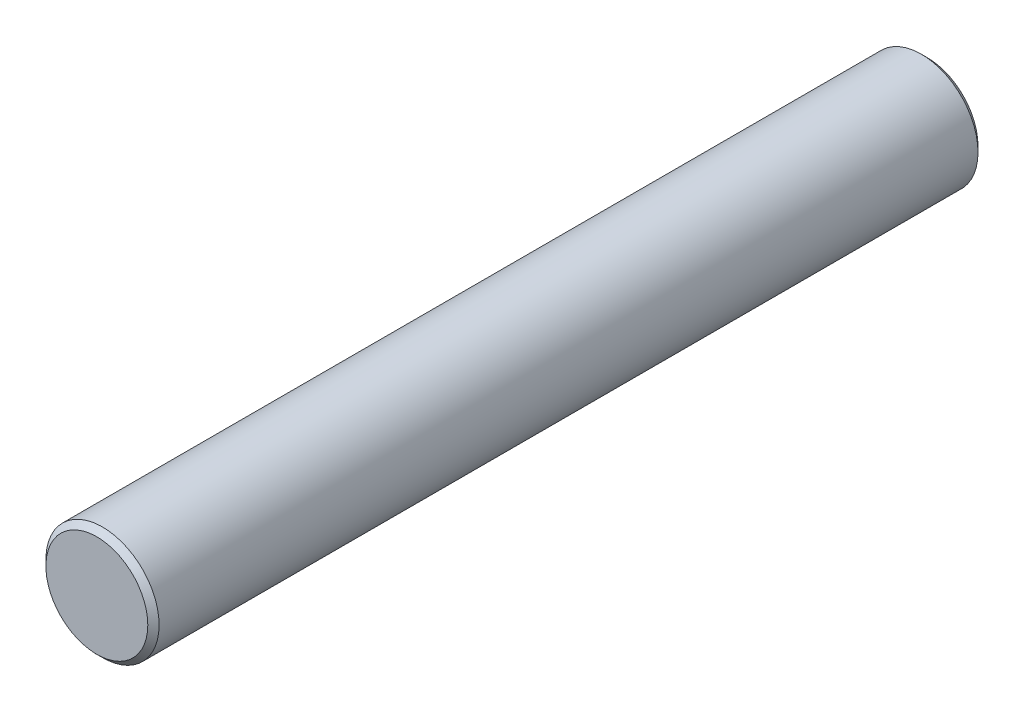
ISO-10303-21;
HEADER;
FILE_DESCRIPTION(('STEP AP214'),'2;1');
FILE_NAME('part.step','',(''),(''),'','','');
FILE_SCHEMA(('AUTOMOTIVE_DESIGN { 1 0 10303 214 1 1 1 1 }'));
ENDSEC;
DATA;
#1=APPLICATION_CONTEXT('core data for automotive mechanical design processes');
#2=APPLICATION_PROTOCOL_DEFINITION('international standard','automotive_design',2000,#1);
#3=PRODUCT_CONTEXT('',#1,'mechanical');
#4=PRODUCT('Part','Part','',(#3));
#5=PRODUCT_RELATED_PRODUCT_CATEGORY('part','',(#4));
#6=PRODUCT_DEFINITION_FORMATION('','',#4);
#7=PRODUCT_DEFINITION_CONTEXT('part definition',#1,'design');
#8=PRODUCT_DEFINITION('design','',#6,#7);
#9=PRODUCT_DEFINITION_SHAPE('','',#8);
#10=(LENGTH_UNIT() NAMED_UNIT(*) SI_UNIT(.MILLI.,.METRE.));
#11=(NAMED_UNIT(*) PLANE_ANGLE_UNIT() SI_UNIT($,.RADIAN.));
#12=(NAMED_UNIT(*) SI_UNIT($,.STERADIAN.) SOLID_ANGLE_UNIT());
#13=UNCERTAINTY_MEASURE_WITH_UNIT(LENGTH_MEASURE(1.E-05),#10,'distance_accuracy_value','');
#14=(GEOMETRIC_REPRESENTATION_CONTEXT(3) GLOBAL_UNCERTAINTY_ASSIGNED_CONTEXT((#13)) GLOBAL_UNIT_ASSIGNED_CONTEXT((#10,
#11,#12)) REPRESENTATION_CONTEXT('',''));
#15=CARTESIAN_POINT('',(0.,0.,0.));
#16=DIRECTION('',(0.,0.,1.));
#17=DIRECTION('',(1.,0.,0.));
#18=AXIS2_PLACEMENT_3D('',#15,#16,#17);
#19=CARTESIAN_POINT('',(0.,0.,11.));
#20=DIRECTION('',(0.,0.,-1.));
#21=DIRECTION('',(-1.,0.,0.));
#22=AXIS2_PLACEMENT_3D('',#19,#20,#21);
#23=CYLINDRICAL_SURFACE('',#22,1.5);
#24=CARTESIAN_POINT('',(0.,0.,-10.85));
#25=DIRECTION('',(0.,0.,1.));
#26=DIRECTION('',(1.,0.,0.));
#27=AXIS2_PLACEMENT_3D('',#24,#25,#26);
#28=CIRCLE('',#27,1.5);
#29=CARTESIAN_POINT('',(1.5,0.,-10.85));
#30=VERTEX_POINT('',#29);
#31=EDGE_CURVE('E46',#30,#30,#28,.T.);
#32=ORIENTED_EDGE('',*,*,#31,.T.);
#33=EDGE_LOOP('',(#32));
#34=FACE_BOUND('',#33,.T.);
#35=CARTESIAN_POINT('',(0.,0.,10.85));
#36=DIRECTION('',(0.,0.,1.));
#37=DIRECTION('',(1.,0.,0.));
#38=AXIS2_PLACEMENT_3D('',#35,#36,#37);
#39=CIRCLE('',#38,1.5);
#40=CARTESIAN_POINT('',(1.5,0.,10.85));
#41=VERTEX_POINT('',#40);
#42=EDGE_CURVE('E50',#41,#41,#39,.F.);
#43=ORIENTED_EDGE('',*,*,#42,.T.);
#44=EDGE_LOOP('',(#43));
#45=FACE_BOUND('',#44,.T.);
#46=ADVANCED_FACE('F34',(#34,#45),#23,.T.);
#47=CARTESIAN_POINT('',(0.,0.,11.));
#48=DIRECTION('',(0.,0.,1.));
#49=DIRECTION('',(1.,0.,0.));
#50=AXIS2_PLACEMENT_3D('',#47,#48,#49);
#51=PLANE('',#50);
#52=CARTESIAN_POINT('',(0.,0.,11.));
#53=DIRECTION('',(0.,0.,1.));
#54=DIRECTION('',(1.,0.,0.));
#55=AXIS2_PLACEMENT_3D('',#52,#53,#54);
#56=CIRCLE('',#55,1.35);
#57=CARTESIAN_POINT('',(1.35,0.,11.));
#58=VERTEX_POINT('',#57);
#59=EDGE_CURVE('E10',#58,#58,#56,.T.);
#60=ORIENTED_EDGE('',*,*,#59,.T.);
#61=EDGE_LOOP('',(#60));
#62=FACE_BOUND('',#61,.T.);
#63=ADVANCED_FACE('F66',(#62),#51,.T.);
#64=CARTESIAN_POINT('',(0.,0.,-11.));
#65=DIRECTION('',(0.,0.,1.));
#66=DIRECTION('',(1.,0.,0.));
#67=AXIS2_PLACEMENT_3D('',#64,#65,#66);
#68=PLANE('',#67);
#69=CARTESIAN_POINT('',(0.,0.,-11.));
#70=DIRECTION('',(0.,0.,1.));
#71=DIRECTION('',(1.,0.,0.));
#72=AXIS2_PLACEMENT_3D('',#69,#70,#71);
#73=CIRCLE('',#72,1.35);
#74=CARTESIAN_POINT('',(1.35,0.,-11.));
#75=VERTEX_POINT('',#74);
#76=EDGE_CURVE('E42',#75,#75,#73,.F.);
#77=ORIENTED_EDGE('',*,*,#76,.T.);
#78=EDGE_LOOP('',(#77));
#79=FACE_BOUND('',#78,.T.);
#80=ADVANCED_FACE('F63',(#79),#68,.F.);
#81=CARTESIAN_POINT('',(0.,0.,-10.85));
#82=DIRECTION('',(0.,0.,1.));
#83=DIRECTION('',(1.,0.,0.));
#84=AXIS2_PLACEMENT_3D('',#81,#82,#83);
#85=CONICAL_SURFACE('',#84,1.5,0.785398163397449);
#86=ORIENTED_EDGE('',*,*,#76,.F.);
#87=EDGE_LOOP('',(#86));
#88=FACE_BOUND('',#87,.T.);
#89=ORIENTED_EDGE('',*,*,#31,.F.);
#90=EDGE_LOOP('',(#89));
#91=FACE_BOUND('',#90,.T.);
#92=ADVANCED_FACE('F59',(#88,#91),#85,.T.);
#93=CARTESIAN_POINT('',(0.,0.,11.));
#94=DIRECTION('',(0.,0.,-1.));
#95=DIRECTION('',(-1.,0.,0.));
#96=AXIS2_PLACEMENT_3D('',#93,#94,#95);
#97=CONICAL_SURFACE('',#96,1.35,0.785398163397449);
#98=ORIENTED_EDGE('',*,*,#42,.F.);
#99=EDGE_LOOP('',(#98));
#100=FACE_BOUND('',#99,.T.);
#101=ORIENTED_EDGE('',*,*,#59,.F.);
#102=EDGE_LOOP('',(#101));
#103=FACE_BOUND('',#102,.T.);
#104=ADVANCED_FACE('F37',(#100,#103),#97,.T.);
#105=CLOSED_SHELL('',(#46,#63,#80,#92,#104));
#106=MANIFOLD_SOLID_BREP('B2',#105);
#107=ADVANCED_BREP_SHAPE_REPRESENTATION('',(#18,#106),#14);
#108=SHAPE_DEFINITION_REPRESENTATION(#9,#107);
ENDSEC;
END-ISO-10303-21;
